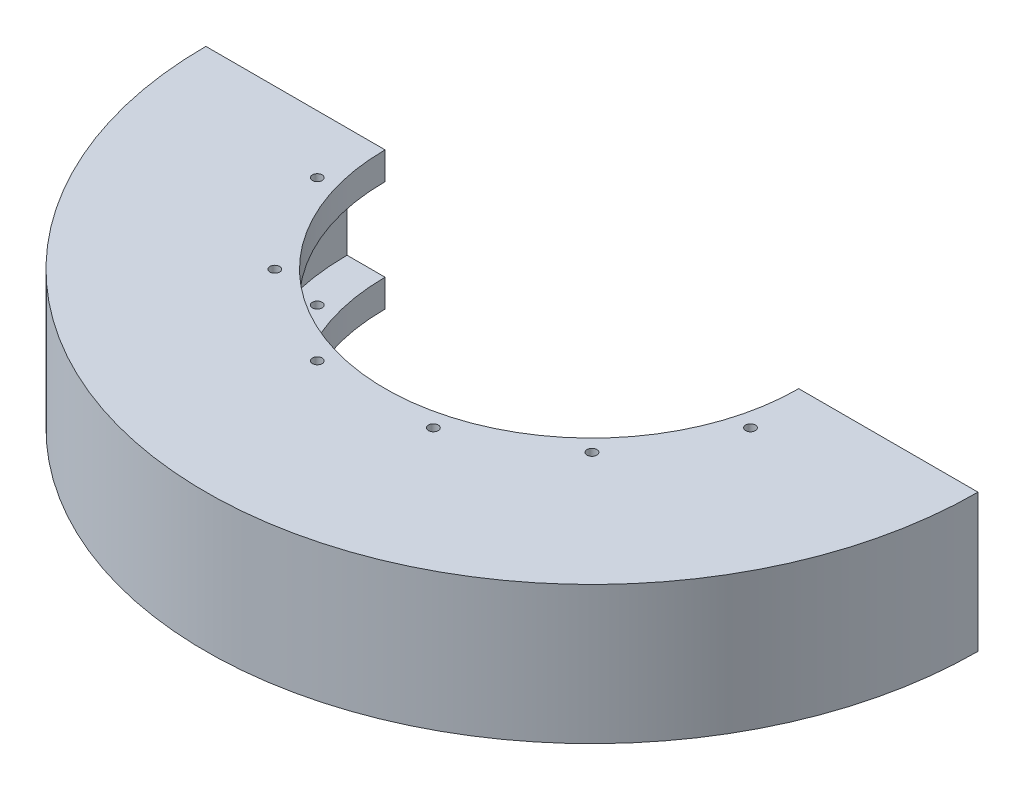
ISO-10303-21;
HEADER;
FILE_DESCRIPTION(('STEP AP214'),'2;1');
FILE_NAME('part.step','',(''),(''),'','','');
FILE_SCHEMA(('AUTOMOTIVE_DESIGN { 1 0 10303 214 1 1 1 1 }'));
ENDSEC;
DATA;
#1=APPLICATION_CONTEXT('core data for automotive mechanical design processes');
#2=APPLICATION_PROTOCOL_DEFINITION('international standard','automotive_design',2000,#1);
#3=PRODUCT_CONTEXT('',#1,'mechanical');
#4=PRODUCT('Part','Part','',(#3));
#5=PRODUCT_RELATED_PRODUCT_CATEGORY('part','',(#4));
#6=PRODUCT_DEFINITION_FORMATION('','',#4);
#7=PRODUCT_DEFINITION_CONTEXT('part definition',#1,'design');
#8=PRODUCT_DEFINITION('design','',#6,#7);
#9=PRODUCT_DEFINITION_SHAPE('','',#8);
#10=(LENGTH_UNIT() NAMED_UNIT(*) SI_UNIT(.MILLI.,.METRE.));
#11=(NAMED_UNIT(*) PLANE_ANGLE_UNIT() SI_UNIT($,.RADIAN.));
#12=(NAMED_UNIT(*) SI_UNIT($,.STERADIAN.) SOLID_ANGLE_UNIT());
#13=UNCERTAINTY_MEASURE_WITH_UNIT(LENGTH_MEASURE(1.E-05),#10,'distance_accuracy_value','');
#14=(GEOMETRIC_REPRESENTATION_CONTEXT(3) GLOBAL_UNCERTAINTY_ASSIGNED_CONTEXT((#13)) GLOBAL_UNIT_ASSIGNED_CONTEXT((#10,
#11,#12)) REPRESENTATION_CONTEXT('',''));
#15=CARTESIAN_POINT('',(0.,0.,0.));
#16=DIRECTION('',(0.,0.,1.));
#17=DIRECTION('',(1.,0.,0.));
#18=AXIS2_PLACEMENT_3D('',#15,#16,#17);
#19=CARTESIAN_POINT('',(0.,22.5392867230028,0.));
#20=DIRECTION('',(0.,1.,0.));
#21=DIRECTION('',(0.,0.,1.));
#22=AXIS2_PLACEMENT_3D('',#19,#20,#21);
#23=CYLINDRICAL_SURFACE('',#22,56.388);
#24=CARTESIAN_POINT('',(0.,9.525,0.));
#25=DIRECTION('',(0.,1.,0.));
#26=DIRECTION('',(0.,0.,1.));
#27=AXIS2_PLACEMENT_3D('',#24,#25,#26);
#28=CIRCLE('',#27,56.388);
#29=CARTESIAN_POINT('',(-56.388,9.525,-3.93755299469373E-13));
#30=VERTEX_POINT('',#29);
#31=CARTESIAN_POINT('',(56.388,9.525,0.));
#32=VERTEX_POINT('',#31);
#33=EDGE_CURVE('E11',#30,#32,#28,.T.);
#34=ORIENTED_EDGE('',*,*,#33,.T.);
#35=DIRECTION('',(0.,-1.,0.));
#36=VECTOR('',#35,1.);
#37=CARTESIAN_POINT('',(56.388,0.,0.));
#38=LINE('',#37,#36);
#39=CARTESIAN_POINT('',(56.388,-9.525,0.));
#40=VERTEX_POINT('',#39);
#41=EDGE_CURVE('E112',#32,#40,#38,.T.);
#42=ORIENTED_EDGE('',*,*,#41,.T.);
#43=CARTESIAN_POINT('',(0.,-9.525,0.));
#44=DIRECTION('',(0.,1.,0.));
#45=DIRECTION('',(0.,0.,1.));
#46=AXIS2_PLACEMENT_3D('',#43,#44,#45);
#47=CIRCLE('',#46,56.388);
#48=CARTESIAN_POINT('',(-56.388,-9.525,-3.93755299469373E-13));
#49=VERTEX_POINT('',#48);
#50=EDGE_CURVE('E98',#49,#40,#47,.T.);
#51=ORIENTED_EDGE('',*,*,#50,.F.);
#52=DIRECTION('',(0.,-1.,0.));
#53=VECTOR('',#52,1.);
#54=CARTESIAN_POINT('',(-56.388,0.,-3.93755299469373E-13));
#55=LINE('',#54,#53);
#56=EDGE_CURVE('E47',#30,#49,#55,.T.);
#57=ORIENTED_EDGE('',*,*,#56,.F.);
#58=EDGE_LOOP('',(#34,#42,#51,#57));
#59=FACE_BOUND('',#58,.T.);
#60=ADVANCED_FACE('F33',(#59),#23,.F.);
#61=CARTESIAN_POINT('',(-56.388,9.525,-3.93755299469373E-13));
#62=DIRECTION('',(0.,1.,0.));
#63=DIRECTION('',(0.,0.,1.));
#64=AXIS2_PLACEMENT_3D('',#61,#62,#63);
#65=PLANE('',#64);
#66=CARTESIAN_POINT('',(36.5137213882679,9.525,36.5137213882665));
#67=DIRECTION('',(0.,1.,0.));
#68=DIRECTION('',(0.,0.,1.));
#69=AXIS2_PLACEMENT_3D('',#66,#67,#68);
#70=CIRCLE('',#69,1.13029999999999);
#71=CARTESIAN_POINT('',(36.5137213882679,9.525,37.6440213882664));
#72=VERTEX_POINT('',#71);
#73=EDGE_CURVE('E400',#72,#72,#70,.T.);
#74=ORIENTED_EDGE('',*,*,#73,.T.);
#75=EDGE_LOOP('',(#74));
#76=FACE_BOUND('',#75,.T.);
#77=CARTESIAN_POINT('',(13.3649496148139,9.525,49.8786710030799));
#78=DIRECTION('',(0.,1.,0.));
#79=DIRECTION('',(0.,0.,1.));
#80=AXIS2_PLACEMENT_3D('',#77,#78,#79);
#81=CIRCLE('',#80,1.13029999999999);
#82=CARTESIAN_POINT('',(13.3649496148139,9.525,51.0089710030799));
#83=VERTEX_POINT('',#82);
#84=EDGE_CURVE('E388',#83,#83,#81,.T.);
#85=ORIENTED_EDGE('',*,*,#84,.T.);
#86=EDGE_LOOP('',(#85));
#87=FACE_BOUND('',#86,.T.);
#88=CARTESIAN_POINT('',(-13.3649496148121,9.525,49.8786710030804));
#89=DIRECTION('',(0.,1.,0.));
#90=DIRECTION('',(0.,0.,1.));
#91=AXIS2_PLACEMENT_3D('',#88,#89,#90);
#92=CIRCLE('',#91,1.13029999999999);
#93=CARTESIAN_POINT('',(-13.3649496148121,9.525,51.0089710030804));
#94=VERTEX_POINT('',#93);
#95=EDGE_CURVE('E376',#94,#94,#92,.T.);
#96=ORIENTED_EDGE('',*,*,#95,.T.);
#97=EDGE_LOOP('',(#96));
#98=FACE_BOUND('',#97,.T.);
#99=CARTESIAN_POINT('',(-36.5137213882666,9.525,36.5137213882678));
#100=DIRECTION('',(0.,1.,0.));
#101=DIRECTION('',(0.,0.,1.));
#102=AXIS2_PLACEMENT_3D('',#99,#100,#101);
#103=CIRCLE('',#102,1.13029999999999);
#104=CARTESIAN_POINT('',(-36.5137213882666,9.525,37.6440213882678));
#105=VERTEX_POINT('',#104);
#106=EDGE_CURVE('E367',#105,#105,#103,.T.);
#107=ORIENTED_EDGE('',*,*,#106,.T.);
#108=EDGE_LOOP('',(#107));
#109=FACE_BOUND('',#108,.T.);
#110=CARTESIAN_POINT('',(-49.87867100308,9.525,13.3649496148137));
#111=DIRECTION('',(0.,1.,0.));
#112=DIRECTION('',(0.,0.,1.));
#113=AXIS2_PLACEMENT_3D('',#110,#111,#112);
#114=CIRCLE('',#113,1.13029999999999);
#115=CARTESIAN_POINT('',(-49.87867100308,9.525,14.4952496148137));
#116=VERTEX_POINT('',#115);
#117=EDGE_CURVE('E355',#116,#116,#114,.T.);
#118=ORIENTED_EDGE('',*,*,#117,.T.);
#119=EDGE_LOOP('',(#118));
#120=FACE_BOUND('',#119,.T.);
#121=CARTESIAN_POINT('',(49.8786710030803,9.525,13.3649496148126));
#122=DIRECTION('',(0.,1.,0.));
#123=DIRECTION('',(0.,0.,1.));
#124=AXIS2_PLACEMENT_3D('',#121,#122,#123);
#125=CIRCLE('',#124,1.13029999999999);
#126=CARTESIAN_POINT('',(49.8786710030803,9.525,14.4952496148126));
#127=VERTEX_POINT('',#126);
#128=EDGE_CURVE('E36',#127,#127,#125,.T.);
#129=ORIENTED_EDGE('',*,*,#128,.T.);
#130=EDGE_LOOP('',(#129));
#131=FACE_BOUND('',#130,.T.);
#132=CARTESIAN_POINT('',(0.,9.525,0.));
#133=DIRECTION('',(0.,1.,0.));
#134=DIRECTION('',(0.,0.,1.));
#135=AXIS2_PLACEMENT_3D('',#132,#133,#134);
#136=CIRCLE('',#135,47.625);
#137=CARTESIAN_POINT('',(-47.625,9.525,-3.32563597524808E-13));
#138=VERTEX_POINT('',#137);
#139=CARTESIAN_POINT('',(47.625,9.525,0.));
#140=VERTEX_POINT('',#139);
#141=EDGE_CURVE('E41',#138,#140,#136,.T.);
#142=ORIENTED_EDGE('',*,*,#141,.T.);
#143=DIRECTION('',(1.,0.,0.));
#144=VECTOR('',#143,1.);
#145=CARTESIAN_POINT('',(56.388,9.525,0.));
#146=LINE('',#145,#144);
#147=EDGE_CURVE('E136',#140,#32,#146,.T.);
#148=ORIENTED_EDGE('',*,*,#147,.T.);
#149=ORIENTED_EDGE('',*,*,#33,.F.);
#150=DIRECTION('',(-1.,0.,0.));
#151=VECTOR('',#150,1.);
#152=CARTESIAN_POINT('',(-56.388,9.525,-3.93755299469373E-13));
#153=LINE('',#152,#151);
#154=EDGE_CURVE('E107',#138,#30,#153,.T.);
#155=ORIENTED_EDGE('',*,*,#154,.F.);
#156=EDGE_LOOP('',(#142,#148,#149,#155));
#157=FACE_BOUND('',#156,.T.);
#158=ADVANCED_FACE('F167',(#76,#87,#98,#109,#120,#131,#157),#65,.F.);
#159=CARTESIAN_POINT('',(0.,22.5392867230028,0.));
#160=DIRECTION('',(0.,1.,0.));
#161=DIRECTION('',(0.,0.,1.));
#162=AXIS2_PLACEMENT_3D('',#159,#160,#161);
#163=CYLINDRICAL_SURFACE('',#162,47.625);
#164=CARTESIAN_POINT('',(0.,15.875,0.));
#165=DIRECTION('',(0.,1.,0.));
#166=DIRECTION('',(0.,0.,1.));
#167=AXIS2_PLACEMENT_3D('',#164,#165,#166);
#168=CIRCLE('',#167,47.625);
#169=CARTESIAN_POINT('',(-47.625,15.875,-3.32563597524808E-13));
#170=VERTEX_POINT('',#169);
#171=CARTESIAN_POINT('',(47.625,15.875,0.));
#172=VERTEX_POINT('',#171);
#173=EDGE_CURVE('E163',#170,#172,#168,.T.);
#174=ORIENTED_EDGE('',*,*,#173,.T.);
#175=DIRECTION('',(0.,-1.,0.));
#176=VECTOR('',#175,1.);
#177=CARTESIAN_POINT('',(47.625,9.525,0.));
#178=LINE('',#177,#176);
#179=EDGE_CURVE('E134',#172,#140,#178,.T.);
#180=ORIENTED_EDGE('',*,*,#179,.T.);
#181=ORIENTED_EDGE('',*,*,#141,.F.);
#182=DIRECTION('',(0.,-1.,0.));
#183=VECTOR('',#182,1.);
#184=CARTESIAN_POINT('',(-47.625,9.525,-3.32563597524808E-13));
#185=LINE('',#184,#183);
#186=EDGE_CURVE('E152',#170,#138,#185,.T.);
#187=ORIENTED_EDGE('',*,*,#186,.F.);
#188=EDGE_LOOP('',(#174,#180,#181,#187));
#189=FACE_BOUND('',#188,.T.);
#190=ADVANCED_FACE('F169',(#189),#163,.F.);
#191=CARTESIAN_POINT('',(-47.625,15.875,-3.32563597524808E-13));
#192=DIRECTION('',(0.,-1.,0.));
#193=DIRECTION('',(0.,0.,-1.));
#194=AXIS2_PLACEMENT_3D('',#191,#192,#193);
#195=PLANE('',#194);
#196=CARTESIAN_POINT('',(36.5137213882679,15.875,36.5137213882665));
#197=DIRECTION('',(0.,1.,0.));
#198=DIRECTION('',(0.,0.,1.));
#199=AXIS2_PLACEMENT_3D('',#196,#197,#198);
#200=CIRCLE('',#199,1.13029999999999);
#201=CARTESIAN_POINT('',(36.5137213882679,15.875,37.6440213882664));
#202=VERTEX_POINT('',#201);
#203=EDGE_CURVE('E408',#202,#202,#200,.T.);
#204=ORIENTED_EDGE('',*,*,#203,.F.);
#205=EDGE_LOOP('',(#204));
#206=FACE_BOUND('',#205,.T.);
#207=CARTESIAN_POINT('',(13.3649496148139,15.875,49.8786710030799));
#208=DIRECTION('',(0.,1.,0.));
#209=DIRECTION('',(0.,0.,1.));
#210=AXIS2_PLACEMENT_3D('',#207,#208,#209);
#211=CIRCLE('',#210,1.13029999999999);
#212=CARTESIAN_POINT('',(13.3649496148139,15.875,51.0089710030799));
#213=VERTEX_POINT('',#212);
#214=EDGE_CURVE('E397',#213,#213,#211,.T.);
#215=ORIENTED_EDGE('',*,*,#214,.F.);
#216=EDGE_LOOP('',(#215));
#217=FACE_BOUND('',#216,.T.);
#218=CARTESIAN_POINT('',(-13.3649496148121,15.875,49.8786710030804));
#219=DIRECTION('',(0.,1.,0.));
#220=DIRECTION('',(0.,0.,1.));
#221=AXIS2_PLACEMENT_3D('',#218,#219,#220);
#222=CIRCLE('',#221,1.13029999999999);
#223=CARTESIAN_POINT('',(-13.3649496148121,15.875,51.0089710030804));
#224=VERTEX_POINT('',#223);
#225=EDGE_CURVE('E385',#224,#224,#222,.T.);
#226=ORIENTED_EDGE('',*,*,#225,.F.);
#227=EDGE_LOOP('',(#226));
#228=FACE_BOUND('',#227,.T.);
#229=CARTESIAN_POINT('',(-36.5137213882666,15.875,36.5137213882678));
#230=DIRECTION('',(0.,1.,0.));
#231=DIRECTION('',(0.,0.,1.));
#232=AXIS2_PLACEMENT_3D('',#229,#230,#231);
#233=CIRCLE('',#232,1.13029999999999);
#234=CARTESIAN_POINT('',(-36.5137213882666,15.875,37.6440213882678));
#235=VERTEX_POINT('',#234);
#236=EDGE_CURVE('E373',#235,#235,#233,.T.);
#237=ORIENTED_EDGE('',*,*,#236,.F.);
#238=EDGE_LOOP('',(#237));
#239=FACE_BOUND('',#238,.T.);
#240=CARTESIAN_POINT('',(-49.87867100308,15.875,13.3649496148137));
#241=DIRECTION('',(0.,1.,0.));
#242=DIRECTION('',(0.,0.,1.));
#243=AXIS2_PLACEMENT_3D('',#240,#241,#242);
#244=CIRCLE('',#243,1.13029999999999);
#245=CARTESIAN_POINT('',(-49.87867100308,15.875,14.4952496148137));
#246=VERTEX_POINT('',#245);
#247=EDGE_CURVE('E361',#246,#246,#244,.T.);
#248=ORIENTED_EDGE('',*,*,#247,.F.);
#249=EDGE_LOOP('',(#248));
#250=FACE_BOUND('',#249,.T.);
#251=CARTESIAN_POINT('',(49.8786710030803,15.875,13.3649496148126));
#252=DIRECTION('',(0.,1.,0.));
#253=DIRECTION('',(0.,0.,1.));
#254=AXIS2_PLACEMENT_3D('',#251,#252,#253);
#255=CIRCLE('',#254,1.13029999999999);
#256=CARTESIAN_POINT('',(49.8786710030803,15.875,14.4952496148126));
#257=VERTEX_POINT('',#256);
#258=EDGE_CURVE('E347',#257,#257,#255,.T.);
#259=ORIENTED_EDGE('',*,*,#258,.F.);
#260=EDGE_LOOP('',(#259));
#261=FACE_BOUND('',#260,.T.);
#262=CARTESIAN_POINT('',(0.,15.875,0.));
#263=DIRECTION('',(0.,1.,0.));
#264=DIRECTION('',(0.,0.,1.));
#265=AXIS2_PLACEMENT_3D('',#262,#263,#264);
#266=CIRCLE('',#265,88.9);
#267=CARTESIAN_POINT('',(-88.9,15.875,-6.20785382046309E-13));
#268=VERTEX_POINT('',#267);
#269=CARTESIAN_POINT('',(88.9,15.875,0.));
#270=VERTEX_POINT('',#269);
#271=EDGE_CURVE('E161',#268,#270,#266,.T.);
#272=ORIENTED_EDGE('',*,*,#271,.T.);
#273=DIRECTION('',(-1.,0.,0.));
#274=VECTOR('',#273,1.);
#275=CARTESIAN_POINT('',(47.625,15.875,0.));
#276=LINE('',#275,#274);
#277=EDGE_CURVE('E131',#270,#172,#276,.T.);
#278=ORIENTED_EDGE('',*,*,#277,.T.);
#279=ORIENTED_EDGE('',*,*,#173,.F.);
#280=DIRECTION('',(1.,0.,0.));
#281=VECTOR('',#280,1.);
#282=CARTESIAN_POINT('',(-47.625,15.875,-3.32563597524808E-13));
#283=LINE('',#282,#281);
#284=EDGE_CURVE('E149',#268,#170,#283,.T.);
#285=ORIENTED_EDGE('',*,*,#284,.F.);
#286=EDGE_LOOP('',(#272,#278,#279,#285));
#287=FACE_BOUND('',#286,.T.);
#288=ADVANCED_FACE('F173',(#206,#217,#228,#239,#250,#261,#287),#195,.F.);
#289=CARTESIAN_POINT('',(0.,22.5392867230028,0.));
#290=DIRECTION('',(0.,1.,0.));
#291=DIRECTION('',(0.,0.,1.));
#292=AXIS2_PLACEMENT_3D('',#289,#290,#291);
#293=CYLINDRICAL_SURFACE('',#292,88.9);
#294=CARTESIAN_POINT('',(0.,-15.875,0.));
#295=DIRECTION('',(0.,1.,0.));
#296=DIRECTION('',(0.,0.,1.));
#297=AXIS2_PLACEMENT_3D('',#294,#295,#296);
#298=CIRCLE('',#297,88.9);
#299=CARTESIAN_POINT('',(-88.9,-15.875,-6.20785382046309E-13));
#300=VERTEX_POINT('',#299);
#301=CARTESIAN_POINT('',(88.9,-15.875,0.));
#302=VERTEX_POINT('',#301);
#303=EDGE_CURVE('E159',#300,#302,#298,.T.);
#304=ORIENTED_EDGE('',*,*,#303,.T.);
#305=DIRECTION('',(0.,1.,0.));
#306=VECTOR('',#305,1.);
#307=CARTESIAN_POINT('',(88.9,15.875,0.));
#308=LINE('',#307,#306);
#309=EDGE_CURVE('E128',#302,#270,#308,.T.);
#310=ORIENTED_EDGE('',*,*,#309,.T.);
#311=ORIENTED_EDGE('',*,*,#271,.F.);
#312=DIRECTION('',(0.,1.,0.));
#313=VECTOR('',#312,1.);
#314=CARTESIAN_POINT('',(-88.9,15.875,-6.20785382046309E-13));
#315=LINE('',#314,#313);
#316=EDGE_CURVE('E146',#300,#268,#315,.T.);
#317=ORIENTED_EDGE('',*,*,#316,.F.);
#318=EDGE_LOOP('',(#304,#310,#311,#317));
#319=FACE_BOUND('',#318,.T.);
#320=ADVANCED_FACE('F177',(#319),#293,.T.);
#321=CARTESIAN_POINT('',(-47.625,-15.875,-3.32563597524809E-13));
#322=DIRECTION('',(0.,1.,0.));
#323=DIRECTION('',(0.,0.,1.));
#324=AXIS2_PLACEMENT_3D('',#321,#322,#323);
#325=PLANE('',#324);
#326=CARTESIAN_POINT('',(36.5137213882679,-15.875,36.5137213882665));
#327=DIRECTION('',(0.,1.,0.));
#328=DIRECTION('',(0.,0.,1.));
#329=AXIS2_PLACEMENT_3D('',#326,#327,#328);
#330=CIRCLE('',#329,1.13029999999999);
#331=CARTESIAN_POINT('',(36.5137213882679,-15.875,37.6440213882665));
#332=VERTEX_POINT('',#331);
#333=EDGE_CURVE('E405',#332,#332,#330,.T.);
#334=ORIENTED_EDGE('',*,*,#333,.T.);
#335=EDGE_LOOP('',(#334));
#336=FACE_BOUND('',#335,.T.);
#337=CARTESIAN_POINT('',(13.3649496148139,-15.875,49.8786710030799));
#338=DIRECTION('',(0.,1.,0.));
#339=DIRECTION('',(0.,0.,1.));
#340=AXIS2_PLACEMENT_3D('',#337,#338,#339);
#341=CIRCLE('',#340,1.1303);
#342=CARTESIAN_POINT('',(13.3649496148139,-15.875,51.0089710030799));
#343=VERTEX_POINT('',#342);
#344=EDGE_CURVE('E394',#343,#343,#341,.T.);
#345=ORIENTED_EDGE('',*,*,#344,.T.);
#346=EDGE_LOOP('',(#345));
#347=FACE_BOUND('',#346,.T.);
#348=CARTESIAN_POINT('',(-13.3649496148121,-15.875,49.8786710030804));
#349=DIRECTION('',(0.,1.,0.));
#350=DIRECTION('',(0.,0.,1.));
#351=AXIS2_PLACEMENT_3D('',#348,#349,#350);
#352=CIRCLE('',#351,1.1303);
#353=CARTESIAN_POINT('',(-13.3649496148121,-15.875,51.0089710030804));
#354=VERTEX_POINT('',#353);
#355=EDGE_CURVE('E382',#354,#354,#352,.T.);
#356=ORIENTED_EDGE('',*,*,#355,.T.);
#357=EDGE_LOOP('',(#356));
#358=FACE_BOUND('',#357,.T.);
#359=CARTESIAN_POINT('',(-36.5137213882666,-15.875,36.5137213882678));
#360=DIRECTION('',(0.,1.,0.));
#361=DIRECTION('',(0.,0.,1.));
#362=AXIS2_PLACEMENT_3D('',#359,#360,#361);
#363=CIRCLE('',#362,1.13029999999999);
#364=CARTESIAN_POINT('',(-36.5137213882666,-15.875,37.6440213882678));
#365=VERTEX_POINT('',#364);
#366=EDGE_CURVE('E370',#365,#365,#363,.T.);
#367=ORIENTED_EDGE('',*,*,#366,.T.);
#368=EDGE_LOOP('',(#367));
#369=FACE_BOUND('',#368,.T.);
#370=CARTESIAN_POINT('',(-49.87867100308,-15.875,13.3649496148137));
#371=DIRECTION('',(0.,1.,0.));
#372=DIRECTION('',(0.,0.,1.));
#373=AXIS2_PLACEMENT_3D('',#370,#371,#372);
#374=CIRCLE('',#373,1.13029999999999);
#375=CARTESIAN_POINT('',(-49.87867100308,-15.875,14.4952496148137));
#376=VERTEX_POINT('',#375);
#377=EDGE_CURVE('E358',#376,#376,#374,.T.);
#378=ORIENTED_EDGE('',*,*,#377,.T.);
#379=EDGE_LOOP('',(#378));
#380=FACE_BOUND('',#379,.T.);
#381=CARTESIAN_POINT('',(49.8786710030803,-15.875,13.3649496148126));
#382=DIRECTION('',(0.,1.,0.));
#383=DIRECTION('',(0.,0.,1.));
#384=AXIS2_PLACEMENT_3D('',#381,#382,#383);
#385=CIRCLE('',#384,1.13029999999999);
#386=CARTESIAN_POINT('',(49.8786710030803,-15.875,14.4952496148126));
#387=VERTEX_POINT('',#386);
#388=EDGE_CURVE('E343',#387,#387,#385,.T.);
#389=ORIENTED_EDGE('',*,*,#388,.T.);
#390=EDGE_LOOP('',(#389));
#391=FACE_BOUND('',#390,.T.);
#392=CARTESIAN_POINT('',(0.,-15.875,0.));
#393=DIRECTION('',(0.,1.,0.));
#394=DIRECTION('',(0.,0.,1.));
#395=AXIS2_PLACEMENT_3D('',#392,#393,#394);
#396=CIRCLE('',#395,47.625);
#397=CARTESIAN_POINT('',(-47.625,-15.875,-3.32563597524809E-13));
#398=VERTEX_POINT('',#397);
#399=CARTESIAN_POINT('',(47.625,-15.875,0.));
#400=VERTEX_POINT('',#399);
#401=EDGE_CURVE('E157',#398,#400,#396,.T.);
#402=ORIENTED_EDGE('',*,*,#401,.T.);
#403=DIRECTION('',(1.,0.,0.));
#404=VECTOR('',#403,1.);
#405=CARTESIAN_POINT('',(47.625,-15.875,0.));
#406=LINE('',#405,#404);
#407=EDGE_CURVE('E125',#400,#302,#406,.T.);
#408=ORIENTED_EDGE('',*,*,#407,.T.);
#409=ORIENTED_EDGE('',*,*,#303,.F.);
#410=DIRECTION('',(-1.,0.,0.));
#411=VECTOR('',#410,1.);
#412=CARTESIAN_POINT('',(-47.625,-15.875,-3.32563597524809E-13));
#413=LINE('',#412,#411);
#414=EDGE_CURVE('E143',#398,#300,#413,.T.);
#415=ORIENTED_EDGE('',*,*,#414,.F.);
#416=EDGE_LOOP('',(#402,#408,#409,#415));
#417=FACE_BOUND('',#416,.T.);
#418=ADVANCED_FACE('F180',(#336,#347,#358,#369,#380,#391,#417),#325,.F.);
#419=CARTESIAN_POINT('',(0.,22.5392867230028,0.));
#420=DIRECTION('',(0.,1.,0.));
#421=DIRECTION('',(0.,0.,1.));
#422=AXIS2_PLACEMENT_3D('',#419,#420,#421);
#423=CYLINDRICAL_SURFACE('',#422,47.625);
#424=CARTESIAN_POINT('',(0.,-9.52500000000001,0.));
#425=DIRECTION('',(0.,1.,0.));
#426=DIRECTION('',(0.,0.,1.));
#427=AXIS2_PLACEMENT_3D('',#424,#425,#426);
#428=CIRCLE('',#427,47.625);
#429=CARTESIAN_POINT('',(-47.625,-9.525,-3.32563597524808E-13));
#430=VERTEX_POINT('',#429);
#431=CARTESIAN_POINT('',(47.625,-9.525,0.));
#432=VERTEX_POINT('',#431);
#433=EDGE_CURVE('E106',#430,#432,#428,.T.);
#434=ORIENTED_EDGE('',*,*,#433,.T.);
#435=DIRECTION('',(0.,-1.,0.));
#436=VECTOR('',#435,1.);
#437=CARTESIAN_POINT('',(47.625,-9.525,0.));
#438=LINE('',#437,#436);
#439=EDGE_CURVE('E115',#432,#400,#438,.T.);
#440=ORIENTED_EDGE('',*,*,#439,.T.);
#441=ORIENTED_EDGE('',*,*,#401,.F.);
#442=DIRECTION('',(0.,-1.,0.));
#443=VECTOR('',#442,1.);
#444=CARTESIAN_POINT('',(-47.625,-9.525,-3.32563597524808E-13));
#445=LINE('',#444,#443);
#446=EDGE_CURVE('E140',#430,#398,#445,.T.);
#447=ORIENTED_EDGE('',*,*,#446,.F.);
#448=EDGE_LOOP('',(#434,#440,#441,#447));
#449=FACE_BOUND('',#448,.T.);
#450=ADVANCED_FACE('F183',(#449),#423,.F.);
#451=CARTESIAN_POINT('',(-56.388,-9.525,-3.93755299469373E-13));
#452=DIRECTION('',(0.,-1.,0.));
#453=DIRECTION('',(0.,0.,-1.));
#454=AXIS2_PLACEMENT_3D('',#451,#452,#453);
#455=PLANE('',#454);
#456=CARTESIAN_POINT('',(36.5137213882679,-9.525,36.5137213882665));
#457=DIRECTION('',(0.,-1.,0.));
#458=DIRECTION('',(0.,0.,-1.));
#459=AXIS2_PLACEMENT_3D('',#456,#457,#458);
#460=CIRCLE('',#459,1.13029999999999);
#461=CARTESIAN_POINT('',(36.5137213882679,-9.525,35.3834213882665));
#462=VERTEX_POINT('',#461);
#463=EDGE_CURVE('E402',#462,#462,#460,.T.);
#464=ORIENTED_EDGE('',*,*,#463,.T.);
#465=EDGE_LOOP('',(#464));
#466=FACE_BOUND('',#465,.T.);
#467=CARTESIAN_POINT('',(13.3649496148139,-9.525,49.8786710030799));
#468=DIRECTION('',(0.,-1.,0.));
#469=DIRECTION('',(0.,0.,-1.));
#470=AXIS2_PLACEMENT_3D('',#467,#468,#469);
#471=CIRCLE('',#470,1.13029999999999);
#472=CARTESIAN_POINT('',(13.3649496148139,-9.525,48.7483710030799));
#473=VERTEX_POINT('',#472);
#474=EDGE_CURVE('E391',#473,#473,#471,.T.);
#475=ORIENTED_EDGE('',*,*,#474,.T.);
#476=EDGE_LOOP('',(#475));
#477=FACE_BOUND('',#476,.T.);
#478=CARTESIAN_POINT('',(-13.3649496148121,-9.525,49.8786710030804));
#479=DIRECTION('',(0.,-1.,0.));
#480=DIRECTION('',(0.,0.,-1.));
#481=AXIS2_PLACEMENT_3D('',#478,#479,#480);
#482=CIRCLE('',#481,1.13029999999999);
#483=CARTESIAN_POINT('',(-13.3649496148121,-9.525,48.7483710030804));
#484=VERTEX_POINT('',#483);
#485=EDGE_CURVE('E379',#484,#484,#482,.T.);
#486=ORIENTED_EDGE('',*,*,#485,.T.);
#487=EDGE_LOOP('',(#486));
#488=FACE_BOUND('',#487,.T.);
#489=CARTESIAN_POINT('',(-36.5137213882666,-9.525,36.5137213882678));
#490=DIRECTION('',(0.,-1.,0.));
#491=DIRECTION('',(0.,0.,-1.));
#492=AXIS2_PLACEMENT_3D('',#489,#490,#491);
#493=CIRCLE('',#492,1.13029999999999);
#494=CARTESIAN_POINT('',(-36.5137213882666,-9.525,35.3834213882678));
#495=VERTEX_POINT('',#494);
#496=EDGE_CURVE('E364',#495,#495,#493,.T.);
#497=ORIENTED_EDGE('',*,*,#496,.T.);
#498=EDGE_LOOP('',(#497));
#499=FACE_BOUND('',#498,.T.);
#500=CARTESIAN_POINT('',(-49.87867100308,-9.525,13.3649496148137));
#501=DIRECTION('',(0.,-1.,0.));
#502=DIRECTION('',(0.,0.,-1.));
#503=AXIS2_PLACEMENT_3D('',#500,#501,#502);
#504=CIRCLE('',#503,1.13029999999999);
#505=CARTESIAN_POINT('',(-49.87867100308,-9.525,12.2346496148137));
#506=VERTEX_POINT('',#505);
#507=EDGE_CURVE('E350',#506,#506,#504,.T.);
#508=ORIENTED_EDGE('',*,*,#507,.T.);
#509=EDGE_LOOP('',(#508));
#510=FACE_BOUND('',#509,.T.);
#511=CARTESIAN_POINT('',(49.8786710030803,-9.525,13.3649496148126));
#512=DIRECTION('',(0.,-1.,0.));
#513=DIRECTION('',(0.,0.,-1.));
#514=AXIS2_PLACEMENT_3D('',#511,#512,#513);
#515=CIRCLE('',#514,1.13029999999999);
#516=CARTESIAN_POINT('',(49.8786710030803,-9.525,12.2346496148127));
#517=VERTEX_POINT('',#516);
#518=EDGE_CURVE('E118',#517,#517,#515,.T.);
#519=ORIENTED_EDGE('',*,*,#518,.T.);
#520=EDGE_LOOP('',(#519));
#521=FACE_BOUND('',#520,.T.);
#522=DIRECTION('',(1.,0.,0.));
#523=VECTOR('',#522,1.);
#524=CARTESIAN_POINT('',(-56.388,-9.525,-3.93755299469373E-13));
#525=LINE('',#524,#523);
#526=EDGE_CURVE('E104',#49,#430,#525,.T.);
#527=ORIENTED_EDGE('',*,*,#526,.F.);
#528=ORIENTED_EDGE('',*,*,#50,.T.);
#529=DIRECTION('',(-1.,0.,0.));
#530=VECTOR('',#529,1.);
#531=CARTESIAN_POINT('',(56.388,-9.525,0.));
#532=LINE('',#531,#530);
#533=EDGE_CURVE('E101',#40,#432,#532,.T.);
#534=ORIENTED_EDGE('',*,*,#533,.T.);
#535=ORIENTED_EDGE('',*,*,#433,.F.);
#536=EDGE_LOOP('',(#527,#528,#534,#535));
#537=FACE_BOUND('',#536,.T.);
#538=ADVANCED_FACE('F100',(#466,#477,#488,#499,#510,#521,#537),#455,.F.);
#539=CARTESIAN_POINT('',(0.,0.,0.));
#540=DIRECTION('',(0.,0.,1.));
#541=DIRECTION('',(1.,0.,0.));
#542=AXIS2_PLACEMENT_3D('',#539,#540,#541);
#543=PLANE('',#542);
#544=ORIENTED_EDGE('',*,*,#56,.T.);
#545=ORIENTED_EDGE('',*,*,#526,.T.);
#546=ORIENTED_EDGE('',*,*,#446,.T.);
#547=ORIENTED_EDGE('',*,*,#414,.T.);
#548=ORIENTED_EDGE('',*,*,#316,.T.);
#549=ORIENTED_EDGE('',*,*,#284,.T.);
#550=ORIENTED_EDGE('',*,*,#186,.T.);
#551=ORIENTED_EDGE('',*,*,#154,.T.);
#552=EDGE_LOOP('',(#544,#545,#546,#547,#548,#549,#550,#551));
#553=FACE_BOUND('',#552,.T.);
#554=ADVANCED_FACE('F185',(#553),#543,.F.);
#555=CARTESIAN_POINT('',(0.,0.,0.));
#556=DIRECTION('',(0.,0.,-1.));
#557=DIRECTION('',(-1.,0.,0.));
#558=AXIS2_PLACEMENT_3D('',#555,#556,#557);
#559=PLANE('',#558);
#560=ORIENTED_EDGE('',*,*,#41,.F.);
#561=ORIENTED_EDGE('',*,*,#147,.F.);
#562=ORIENTED_EDGE('',*,*,#179,.F.);
#563=ORIENTED_EDGE('',*,*,#277,.F.);
#564=ORIENTED_EDGE('',*,*,#309,.F.);
#565=ORIENTED_EDGE('',*,*,#407,.F.);
#566=ORIENTED_EDGE('',*,*,#439,.F.);
#567=ORIENTED_EDGE('',*,*,#533,.F.);
#568=EDGE_LOOP('',(#560,#561,#562,#563,#564,#565,#566,#567));
#569=FACE_BOUND('',#568,.T.);
#570=ADVANCED_FACE('F110',(#569),#559,.T.);
#571=CARTESIAN_POINT('',(49.8786710030803,15.875,13.3649496148126));
#572=DIRECTION('',(0.,1.,0.));
#573=DIRECTION('',(0.,0.,1.));
#574=AXIS2_PLACEMENT_3D('',#571,#572,#573);
#575=CYLINDRICAL_SURFACE('',#574,1.13029999999999);
#576=ORIENTED_EDGE('',*,*,#258,.T.);
#577=EDGE_LOOP('',(#576));
#578=FACE_BOUND('',#577,.T.);
#579=ORIENTED_EDGE('',*,*,#128,.F.);
#580=EDGE_LOOP('',(#579));
#581=FACE_BOUND('',#580,.T.);
#582=ADVANCED_FACE('F192',(#578,#581),#575,.F.);
#583=ORIENTED_EDGE('',*,*,#388,.F.);
#584=EDGE_LOOP('',(#583));
#585=FACE_BOUND('',#584,.T.);
#586=ORIENTED_EDGE('',*,*,#518,.F.);
#587=EDGE_LOOP('',(#586));
#588=FACE_BOUND('',#587,.T.);
#589=ADVANCED_FACE('F241',(#585,#588),#575,.F.);
#590=CARTESIAN_POINT('',(-49.87867100308,15.875,13.3649496148137));
#591=DIRECTION('',(0.,1.,0.));
#592=DIRECTION('',(0.,0.,1.));
#593=AXIS2_PLACEMENT_3D('',#590,#591,#592);
#594=CYLINDRICAL_SURFACE('',#593,1.13029999999999);
#595=ORIENTED_EDGE('',*,*,#247,.T.);
#596=EDGE_LOOP('',(#595));
#597=FACE_BOUND('',#596,.T.);
#598=ORIENTED_EDGE('',*,*,#117,.F.);
#599=EDGE_LOOP('',(#598));
#600=FACE_BOUND('',#599,.T.);
#601=ADVANCED_FACE('F235',(#597,#600),#594,.F.);
#602=ORIENTED_EDGE('',*,*,#377,.F.);
#603=EDGE_LOOP('',(#602));
#604=FACE_BOUND('',#603,.T.);
#605=ORIENTED_EDGE('',*,*,#507,.F.);
#606=EDGE_LOOP('',(#605));
#607=FACE_BOUND('',#606,.T.);
#608=ADVANCED_FACE('F240',(#604,#607),#594,.F.);
#609=CARTESIAN_POINT('',(-36.5137213882666,15.875,36.5137213882678));
#610=DIRECTION('',(0.,1.,0.));
#611=DIRECTION('',(0.,0.,1.));
#612=AXIS2_PLACEMENT_3D('',#609,#610,#611);
#613=CYLINDRICAL_SURFACE('',#612,1.13029999999999);
#614=ORIENTED_EDGE('',*,*,#366,.F.);
#615=EDGE_LOOP('',(#614));
#616=FACE_BOUND('',#615,.T.);
#617=ORIENTED_EDGE('',*,*,#496,.F.);
#618=EDGE_LOOP('',(#617));
#619=FACE_BOUND('',#618,.T.);
#620=ADVANCED_FACE('F253',(#616,#619),#613,.F.);
#621=ORIENTED_EDGE('',*,*,#236,.T.);
#622=EDGE_LOOP('',(#621));
#623=FACE_BOUND('',#622,.T.);
#624=ORIENTED_EDGE('',*,*,#106,.F.);
#625=EDGE_LOOP('',(#624));
#626=FACE_BOUND('',#625,.T.);
#627=ADVANCED_FACE('F262',(#623,#626),#613,.F.);
#628=CARTESIAN_POINT('',(-13.3649496148121,15.875,49.8786710030804));
#629=DIRECTION('',(0.,1.,0.));
#630=DIRECTION('',(0.,0.,1.));
#631=AXIS2_PLACEMENT_3D('',#628,#629,#630);
#632=CYLINDRICAL_SURFACE('',#631,1.13029999999999);
#633=ORIENTED_EDGE('',*,*,#225,.T.);
#634=EDGE_LOOP('',(#633));
#635=FACE_BOUND('',#634,.T.);
#636=ORIENTED_EDGE('',*,*,#95,.F.);
#637=EDGE_LOOP('',(#636));
#638=FACE_BOUND('',#637,.T.);
#639=ADVANCED_FACE('F272',(#635,#638),#632,.F.);
#640=ORIENTED_EDGE('',*,*,#355,.F.);
#641=EDGE_LOOP('',(#640));
#642=FACE_BOUND('',#641,.T.);
#643=ORIENTED_EDGE('',*,*,#485,.F.);
#644=EDGE_LOOP('',(#643));
#645=FACE_BOUND('',#644,.T.);
#646=ADVANCED_FACE('F281',(#642,#645),#632,.F.);
#647=CARTESIAN_POINT('',(13.3649496148139,15.875,49.8786710030799));
#648=DIRECTION('',(0.,1.,0.));
#649=DIRECTION('',(0.,0.,1.));
#650=AXIS2_PLACEMENT_3D('',#647,#648,#649);
#651=CYLINDRICAL_SURFACE('',#650,1.13029999999999);
#652=ORIENTED_EDGE('',*,*,#214,.T.);
#653=EDGE_LOOP('',(#652));
#654=FACE_BOUND('',#653,.T.);
#655=ORIENTED_EDGE('',*,*,#84,.F.);
#656=EDGE_LOOP('',(#655));
#657=FACE_BOUND('',#656,.T.);
#658=ADVANCED_FACE('F291',(#654,#657),#651,.F.);
#659=ORIENTED_EDGE('',*,*,#344,.F.);
#660=EDGE_LOOP('',(#659));
#661=FACE_BOUND('',#660,.T.);
#662=ORIENTED_EDGE('',*,*,#474,.F.);
#663=EDGE_LOOP('',(#662));
#664=FACE_BOUND('',#663,.T.);
#665=ADVANCED_FACE('F300',(#661,#664),#651,.F.);
#666=CARTESIAN_POINT('',(36.5137213882679,15.875,36.5137213882665));
#667=DIRECTION('',(0.,1.,0.));
#668=DIRECTION('',(0.,0.,1.));
#669=AXIS2_PLACEMENT_3D('',#666,#667,#668);
#670=CYLINDRICAL_SURFACE('',#669,1.13029999999999);
#671=ORIENTED_EDGE('',*,*,#203,.T.);
#672=EDGE_LOOP('',(#671));
#673=FACE_BOUND('',#672,.T.);
#674=ORIENTED_EDGE('',*,*,#73,.F.);
#675=EDGE_LOOP('',(#674));
#676=FACE_BOUND('',#675,.T.);
#677=ADVANCED_FACE('F310',(#673,#676),#670,.F.);
#678=ORIENTED_EDGE('',*,*,#333,.F.);
#679=EDGE_LOOP('',(#678));
#680=FACE_BOUND('',#679,.T.);
#681=ORIENTED_EDGE('',*,*,#463,.F.);
#682=EDGE_LOOP('',(#681));
#683=FACE_BOUND('',#682,.T.);
#684=ADVANCED_FACE('F319',(#680,#683),#670,.F.);
#685=CLOSED_SHELL('',(#60,#158,#190,#288,#320,#418,#450,#538,#554,#570,#582,#589,#601,#608,#620,
#627,#639,#646,#658,#665,#677,#684));
#686=MANIFOLD_SOLID_BREP('B2',#685);
#687=ADVANCED_BREP_SHAPE_REPRESENTATION('',(#18,#686),#14);
#688=SHAPE_DEFINITION_REPRESENTATION(#9,#687);
ENDSEC;
END-ISO-10303-21;
